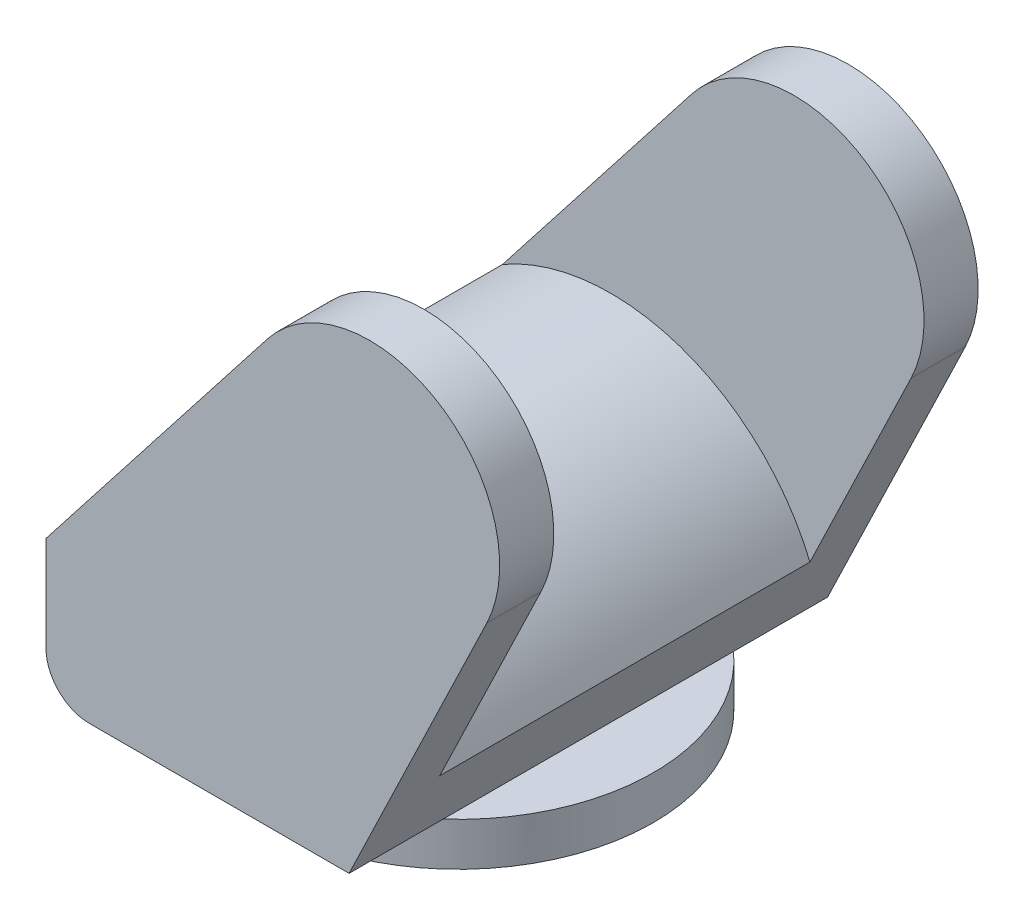
ISO-10303-21;
HEADER;
FILE_DESCRIPTION(('STEP AP214'),'2;1');
FILE_NAME('part.step','',(''),(''),'','','');
FILE_SCHEMA(('AUTOMOTIVE_DESIGN { 1 0 10303 214 1 1 1 1 }'));
ENDSEC;
DATA;
#1=APPLICATION_CONTEXT('core data for automotive mechanical design processes');
#2=APPLICATION_PROTOCOL_DEFINITION('international standard','automotive_design',2000,#1);
#3=PRODUCT_CONTEXT('',#1,'mechanical');
#4=PRODUCT('Part','Part','',(#3));
#5=PRODUCT_RELATED_PRODUCT_CATEGORY('part','',(#4));
#6=PRODUCT_DEFINITION_FORMATION('','',#4);
#7=PRODUCT_DEFINITION_CONTEXT('part definition',#1,'design');
#8=PRODUCT_DEFINITION('design','',#6,#7);
#9=PRODUCT_DEFINITION_SHAPE('','',#8);
#10=(LENGTH_UNIT() NAMED_UNIT(*) SI_UNIT(.MILLI.,.METRE.));
#11=(NAMED_UNIT(*) PLANE_ANGLE_UNIT() SI_UNIT($,.RADIAN.));
#12=(NAMED_UNIT(*) SI_UNIT($,.STERADIAN.) SOLID_ANGLE_UNIT());
#13=UNCERTAINTY_MEASURE_WITH_UNIT(LENGTH_MEASURE(1.E-05),#10,'distance_accuracy_value','');
#14=(GEOMETRIC_REPRESENTATION_CONTEXT(3) GLOBAL_UNCERTAINTY_ASSIGNED_CONTEXT((#13)) GLOBAL_UNIT_ASSIGNED_CONTEXT((#10,
#11,#12)) REPRESENTATION_CONTEXT('',''));
#15=CARTESIAN_POINT('',(0.,0.,0.));
#16=DIRECTION('',(0.,0.,1.));
#17=DIRECTION('',(1.,0.,0.));
#18=AXIS2_PLACEMENT_3D('',#15,#16,#17);
#19=CARTESIAN_POINT('',(64.2928637537417,-51.1093254499614,110.5));
#20=DIRECTION('',(0.,-1.,0.));
#21=DIRECTION('',(-1.,0.,0.));
#22=AXIS2_PLACEMENT_3D('',#19,#20,#21);
#23=PLANE('',#22);
#24=DIRECTION('',(0.,0.,-1.));
#25=VECTOR('',#24,1.);
#26=CARTESIAN_POINT('',(-55.7071362462583,-51.1093254499614,110.5));
#27=LINE('',#26,#25);
#28=CARTESIAN_POINT('',(-55.7071362462583,-51.1093254499614,110.5));
#29=VERTEX_POINT('',#28);
#30=CARTESIAN_POINT('',(-55.7071362462585,-51.1093254499614,67.0820393249939));
#31=VERTEX_POINT('',#30);
#32=EDGE_CURVE('E150',#29,#31,#27,.T.);
#33=ORIENTED_EDGE('',*,*,#32,.T.);
#34=CARTESIAN_POINT('',(4.29286375374131,-51.1093254499614,0.));
#35=DIRECTION('',(0.,-1.,0.));
#36=DIRECTION('',(-1.,0.,0.));
#37=AXIS2_PLACEMENT_3D('',#34,#35,#36);
#38=CIRCLE('',#37,90.);
#39=CARTESIAN_POINT('',(64.2928637537416,-51.1093254499614,67.0820393249935));
#40=VERTEX_POINT('',#39);
#41=EDGE_CURVE('E11',#31,#40,#38,.F.);
#42=ORIENTED_EDGE('',*,*,#41,.T.);
#43=DIRECTION('',(0.,0.,-1.));
#44=VECTOR('',#43,1.);
#45=CARTESIAN_POINT('',(64.2928637537417,-51.1093254499614,110.5));
#46=LINE('',#45,#44);
#47=CARTESIAN_POINT('',(64.2928637537417,-51.1093254499614,110.5));
#48=VERTEX_POINT('',#47);
#49=EDGE_CURVE('E144',#48,#40,#46,.T.);
#50=ORIENTED_EDGE('',*,*,#49,.F.);
#51=DIRECTION('',(-1.,0.,0.));
#52=VECTOR('',#51,1.);
#53=CARTESIAN_POINT('',(64.2928637537417,-51.1093254499614,110.5));
#54=LINE('',#53,#52);
#55=EDGE_CURVE('E176',#48,#29,#54,.T.);
#56=ORIENTED_EDGE('',*,*,#55,.T.);
#57=EDGE_LOOP('',(#33,#42,#50,#56));
#58=FACE_BOUND('',#57,.T.);
#59=ADVANCED_FACE('F34',(#58),#23,.T.);
#60=CARTESIAN_POINT('',(73.8390121494794,106.850674550039,110.5));
#61=DIRECTION('',(0.,0.,-1.));
#62=DIRECTION('',(-1.,0.,0.));
#63=AXIS2_PLACEMENT_3D('',#60,#61,#62);
#64=CYLINDRICAL_SURFACE('',#63,60.);
#65=DIRECTION('',(0.,0.,-1.));
#66=VECTOR('',#65,1.);
#67=CARTESIAN_POINT('',(127.88567183657,80.7938409613649,110.5));
#68=LINE('',#67,#66);
#69=CARTESIAN_POINT('',(127.88567183657,80.7938409613649,110.5));
#70=VERTEX_POINT('',#69);
#71=CARTESIAN_POINT('',(127.88567183657,80.793840961365,85.4999999999996));
#72=VERTEX_POINT('',#71);
#73=EDGE_CURVE('E42',#70,#72,#68,.T.);
#74=ORIENTED_EDGE('',*,*,#73,.T.);
#75=CARTESIAN_POINT('',(73.8390121494793,106.850674550039,85.4999999999997));
#76=DIRECTION('',(0.,0.,-1.));
#77=DIRECTION('',(-1.,0.,0.));
#78=AXIS2_PLACEMENT_3D('',#75,#76,#77);
#79=CIRCLE('',#78,60.);
#80=CARTESIAN_POINT('',(26.5575710181049,143.789344322249,85.4999999999999));
#81=VERTEX_POINT('',#80);
#82=EDGE_CURVE('E215',#81,#72,#79,.T.);
#83=ORIENTED_EDGE('',*,*,#82,.F.);
#84=DIRECTION('',(0.,0.,-1.));
#85=VECTOR('',#84,1.);
#86=CARTESIAN_POINT('',(26.557571018105,143.789344322249,110.5));
#87=LINE('',#86,#85);
#88=CARTESIAN_POINT('',(26.557571018105,143.789344322249,110.5));
#89=VERTEX_POINT('',#88);
#90=EDGE_CURVE('E159',#89,#81,#87,.T.);
#91=ORIENTED_EDGE('',*,*,#90,.F.);
#92=CARTESIAN_POINT('',(73.8390121494794,106.850674550039,110.5));
#93=DIRECTION('',(0.,0.,-1.));
#94=DIRECTION('',(-1.,0.,0.));
#95=AXIS2_PLACEMENT_3D('',#92,#93,#94);
#96=CIRCLE('',#95,60.);
#97=EDGE_CURVE('E143',#89,#70,#96,.T.);
#98=ORIENTED_EDGE('',*,*,#97,.T.);
#99=EDGE_LOOP('',(#74,#83,#91,#98));
#100=FACE_BOUND('',#99,.T.);
#101=ADVANCED_FACE('F236',(#100),#64,.T.);
#102=CARTESIAN_POINT('',(64.2928637537417,-51.1093254499614,110.5));
#103=DIRECTION('',(0.900777661451507,-0.434280559811229,0.));
#104=DIRECTION('',(-0.434280559811229,-0.900777661451507,0.));
#105=AXIS2_PLACEMENT_3D('',#102,#103,#104);
#106=PLANE('',#105);
#107=DIRECTION('',(-0.434280559811229,-0.900777661451507,0.));
#108=VECTOR('',#107,1.);
#109=CARTESIAN_POINT('',(127.885671836569,80.7938409613649,-85.5000000000005));
#110=LINE('',#109,#108);
#111=CARTESIAN_POINT('',(127.885671836569,80.793840961365,-85.5000000000005));
#112=VERTEX_POINT('',#111);
#113=CARTESIAN_POINT('',(81.1498086111907,-16.1449250759018,-85.5000000000003));
#114=VERTEX_POINT('',#113);
#115=EDGE_CURVE('E204',#112,#114,#110,.T.);
#116=ORIENTED_EDGE('',*,*,#115,.T.);
#117=DIRECTION('',(0.,0.,1.));
#118=VECTOR('',#117,1.);
#119=CARTESIAN_POINT('',(81.1498086111907,-16.1449250759018,-85.5000000000003));
#120=LINE('',#119,#118);
#121=CARTESIAN_POINT('',(81.1498086111912,-16.1449250759018,85.4999999999997));
#122=VERTEX_POINT('',#121);
#123=EDGE_CURVE('E196',#114,#122,#120,.T.);
#124=ORIENTED_EDGE('',*,*,#123,.T.);
#125=DIRECTION('',(-0.434280559811229,-0.900777661451507,0.));
#126=VECTOR('',#125,1.);
#127=CARTESIAN_POINT('',(127.88567183657,80.7938409613649,85.4999999999996));
#128=LINE('',#127,#126);
#129=EDGE_CURVE('E213',#72,#122,#128,.T.);
#130=ORIENTED_EDGE('',*,*,#129,.F.);
#131=ORIENTED_EDGE('',*,*,#73,.F.);
#132=DIRECTION('',(-0.434280559811229,-0.900777661451507,0.));
#133=VECTOR('',#132,1.);
#134=CARTESIAN_POINT('',(64.2928637537417,-51.1093254499614,110.5));
#135=LINE('',#134,#133);
#136=EDGE_CURVE('E179',#70,#48,#135,.T.);
#137=ORIENTED_EDGE('',*,*,#136,.T.);
#138=ORIENTED_EDGE('',*,*,#49,.T.);
#139=CARTESIAN_POINT('',(64.2928637537411,-51.1093254499614,-67.0820393249939));
#140=VERTEX_POINT('',#139);
#141=EDGE_CURVE('E126',#40,#140,#46,.T.);
#142=ORIENTED_EDGE('',*,*,#141,.T.);
#143=CARTESIAN_POINT('',(64.2928637537409,-51.1093254499614,-110.5));
#144=VERTEX_POINT('',#143);
#145=EDGE_CURVE('E136',#140,#144,#46,.T.);
#146=ORIENTED_EDGE('',*,*,#145,.T.);
#147=DIRECTION('',(-0.434280559811229,-0.900777661451507,0.));
#148=VECTOR('',#147,1.);
#149=CARTESIAN_POINT('',(64.2928637537409,-51.1093254499614,-110.5));
#150=LINE('',#149,#148);
#151=CARTESIAN_POINT('',(127.885671836569,80.7938409613649,-110.5));
#152=VERTEX_POINT('',#151);
#153=EDGE_CURVE('E194',#152,#144,#150,.T.);
#154=ORIENTED_EDGE('',*,*,#153,.F.);
#155=EDGE_CURVE('E162',#112,#152,#68,.T.);
#156=ORIENTED_EDGE('',*,*,#155,.F.);
#157=EDGE_LOOP('',(#116,#124,#130,#131,#137,#138,#142,#146,#154,#156));
#158=FACE_BOUND('',#157,.T.);
#159=ADVANCED_FACE('F36',(#158),#106,.T.);
#160=CARTESIAN_POINT('',(73.8390121494787,106.850674550039,-85.5000000000003));
#161=DIRECTION('',(0.,0.,-1.));
#162=DIRECTION('',(-1.,0.,0.));
#163=AXIS2_PLACEMENT_3D('',#160,#161,#162);
#164=CIRCLE('',#163,60.);
#165=CARTESIAN_POINT('',(26.5575710181043,143.789344322249,-85.5000000000001));
#166=VERTEX_POINT('',#165);
#167=EDGE_CURVE('E206',#166,#112,#164,.T.);
#168=ORIENTED_EDGE('',*,*,#167,.T.);
#169=ORIENTED_EDGE('',*,*,#155,.T.);
#170=CARTESIAN_POINT('',(73.8390121494786,106.850674550039,-110.5));
#171=DIRECTION('',(0.,0.,-1.));
#172=DIRECTION('',(-1.,0.,0.));
#173=AXIS2_PLACEMENT_3D('',#170,#171,#172);
#174=CIRCLE('',#173,60.);
#175=CARTESIAN_POINT('',(26.5575710181043,143.789344322249,-110.5));
#176=VERTEX_POINT('',#175);
#177=EDGE_CURVE('E181',#176,#152,#174,.T.);
#178=ORIENTED_EDGE('',*,*,#177,.F.);
#179=EDGE_CURVE('E158',#166,#176,#87,.T.);
#180=ORIENTED_EDGE('',*,*,#179,.F.);
#181=EDGE_LOOP('',(#168,#169,#178,#180));
#182=FACE_BOUND('',#181,.T.);
#183=ADVANCED_FACE('F243',(#182),#64,.T.);
#184=CARTESIAN_POINT('',(-75.7071362462583,12.8906745500386,110.5));
#185=DIRECTION('',(-0.78802401885624,0.6156444962035,0.));
#186=DIRECTION('',(0.6156444962035,0.78802401885624,0.));
#187=AXIS2_PLACEMENT_3D('',#184,#185,#186);
#188=PLANE('',#187);
#189=DIRECTION('',(0.6156444962035,0.78802401885624,0.));
#190=VECTOR('',#189,1.);
#191=CARTESIAN_POINT('',(-60.8576190942428,31.8980339211821,-85.4999999999998));
#192=LINE('',#191,#190);
#193=CARTESIAN_POINT('',(-60.8576190942428,31.8980339211821,-85.4999999999998));
#194=VERTEX_POINT('',#193);
#195=EDGE_CURVE('E209',#194,#166,#192,.T.);
#196=ORIENTED_EDGE('',*,*,#195,.T.);
#197=ORIENTED_EDGE('',*,*,#179,.T.);
#198=DIRECTION('',(0.6156444962035,0.78802401885624,0.));
#199=VECTOR('',#198,1.);
#200=CARTESIAN_POINT('',(-75.7071362462591,12.8906745500386,-110.5));
#201=LINE('',#200,#199);
#202=CARTESIAN_POINT('',(-75.7071362462591,12.8906745500386,-110.5));
#203=VERTEX_POINT('',#202);
#204=EDGE_CURVE('E184',#203,#176,#201,.T.);
#205=ORIENTED_EDGE('',*,*,#204,.F.);
#206=DIRECTION('',(0.,0.,-1.));
#207=VECTOR('',#206,1.);
#208=CARTESIAN_POINT('',(-75.7071362462583,12.8906745500386,110.5));
#209=LINE('',#208,#207);
#210=CARTESIAN_POINT('',(-75.7071362462583,12.8906745500386,110.5));
#211=VERTEX_POINT('',#210);
#212=EDGE_CURVE('E156',#211,#203,#209,.T.);
#213=ORIENTED_EDGE('',*,*,#212,.F.);
#214=DIRECTION('',(0.6156444962035,0.78802401885624,0.));
#215=VECTOR('',#214,1.);
#216=CARTESIAN_POINT('',(-75.7071362462583,12.8906745500386,110.5));
#217=LINE('',#216,#215);
#218=EDGE_CURVE('E167',#211,#89,#217,.T.);
#219=ORIENTED_EDGE('',*,*,#218,.T.);
#220=ORIENTED_EDGE('',*,*,#90,.T.);
#221=DIRECTION('',(0.6156444962035,0.78802401885624,0.));
#222=VECTOR('',#221,1.);
#223=CARTESIAN_POINT('',(-60.8576190942422,31.8980339211821,85.5000000000002));
#224=LINE('',#223,#222);
#225=CARTESIAN_POINT('',(-60.8576190942422,31.8980339211821,85.5000000000002));
#226=VERTEX_POINT('',#225);
#227=EDGE_CURVE('E217',#226,#81,#224,.T.);
#228=ORIENTED_EDGE('',*,*,#227,.F.);
#229=DIRECTION('',(0.,0.,1.));
#230=VECTOR('',#229,1.);
#231=CARTESIAN_POINT('',(-60.8576190942428,31.8980339211821,-85.4999999999998));
#232=LINE('',#231,#230);
#233=EDGE_CURVE('E199',#194,#226,#232,.T.);
#234=ORIENTED_EDGE('',*,*,#233,.F.);
#235=EDGE_LOOP('',(#196,#197,#205,#213,#219,#220,#228,#234));
#236=FACE_BOUND('',#235,.T.);
#237=ADVANCED_FACE('F260',(#236),#188,.T.);
#238=CARTESIAN_POINT('',(-75.7071362462583,-31.1093254499614,110.5));
#239=DIRECTION('',(-1.,0.,0.));
#240=DIRECTION('',(0.,0.,1.));
#241=AXIS2_PLACEMENT_3D('',#238,#239,#240);
#242=PLANE('',#241);
#243=ORIENTED_EDGE('',*,*,#212,.T.);
#244=DIRECTION('',(0.,1.,0.));
#245=VECTOR('',#244,1.);
#246=CARTESIAN_POINT('',(-75.7071362462591,-31.1093254499614,-110.5));
#247=LINE('',#246,#245);
#248=CARTESIAN_POINT('',(-75.7071362462591,-31.1093254499614,-110.5));
#249=VERTEX_POINT('',#248);
#250=EDGE_CURVE('E187',#249,#203,#247,.T.);
#251=ORIENTED_EDGE('',*,*,#250,.F.);
#252=DIRECTION('',(0.,0.,-1.));
#253=VECTOR('',#252,1.);
#254=CARTESIAN_POINT('',(-75.7071362462583,-31.1093254499614,110.5));
#255=LINE('',#254,#253);
#256=CARTESIAN_POINT('',(-75.7071362462583,-31.1093254499614,110.5));
#257=VERTEX_POINT('',#256);
#258=EDGE_CURVE('E153',#257,#249,#255,.T.);
#259=ORIENTED_EDGE('',*,*,#258,.F.);
#260=DIRECTION('',(0.,1.,0.));
#261=VECTOR('',#260,1.);
#262=CARTESIAN_POINT('',(-75.7071362462583,-31.1093254499614,110.5));
#263=LINE('',#262,#261);
#264=EDGE_CURVE('E170',#257,#211,#263,.T.);
#265=ORIENTED_EDGE('',*,*,#264,.T.);
#266=EDGE_LOOP('',(#243,#251,#259,#265));
#267=FACE_BOUND('',#266,.T.);
#268=ADVANCED_FACE('F255',(#267),#242,.T.);
#269=CARTESIAN_POINT('',(-55.7071362462583,-31.1093254499614,110.5));
#270=DIRECTION('',(0.,0.,-1.));
#271=DIRECTION('',(-1.,0.,0.));
#272=AXIS2_PLACEMENT_3D('',#269,#270,#271);
#273=CYLINDRICAL_SURFACE('',#272,20.);
#274=ORIENTED_EDGE('',*,*,#258,.T.);
#275=CARTESIAN_POINT('',(-55.7071362462591,-31.1093254499614,-110.5));
#276=DIRECTION('',(0.,0.,-1.));
#277=DIRECTION('',(1.,0.,0.));
#278=AXIS2_PLACEMENT_3D('',#275,#276,#277);
#279=CIRCLE('',#278,20.);
#280=CARTESIAN_POINT('',(-55.7071362462591,-51.1093254499614,-110.5));
#281=VERTEX_POINT('',#280);
#282=EDGE_CURVE('E190',#281,#249,#279,.T.);
#283=ORIENTED_EDGE('',*,*,#282,.F.);
#284=CARTESIAN_POINT('',(-55.7071362462589,-51.1093254499614,-67.0820393249935));
#285=VERTEX_POINT('',#284);
#286=EDGE_CURVE('E148',#285,#281,#27,.T.);
#287=ORIENTED_EDGE('',*,*,#286,.F.);
#288=EDGE_CURVE('E154',#31,#285,#27,.T.);
#289=ORIENTED_EDGE('',*,*,#288,.F.);
#290=ORIENTED_EDGE('',*,*,#32,.F.);
#291=CARTESIAN_POINT('',(-55.7071362462583,-31.1093254499614,110.5));
#292=DIRECTION('',(0.,0.,-1.));
#293=DIRECTION('',(1.,0.,0.));
#294=AXIS2_PLACEMENT_3D('',#291,#292,#293);
#295=CIRCLE('',#294,20.);
#296=EDGE_CURVE('E173',#29,#257,#295,.T.);
#297=ORIENTED_EDGE('',*,*,#296,.T.);
#298=EDGE_LOOP('',(#274,#283,#287,#289,#290,#297));
#299=FACE_BOUND('',#298,.T.);
#300=ADVANCED_FACE('F247',(#299),#273,.T.);
#301=ORIENTED_EDGE('',*,*,#145,.F.);
#302=CARTESIAN_POINT('',(4.29286375374131,-51.1093254499614,0.));
#303=DIRECTION('',(0.,-1.,0.));
#304=DIRECTION('',(-1.,0.,0.));
#305=AXIS2_PLACEMENT_3D('',#302,#303,#304);
#306=CIRCLE('',#305,90.);
#307=EDGE_CURVE('E127',#285,#140,#306,.T.);
#308=ORIENTED_EDGE('',*,*,#307,.F.);
#309=ORIENTED_EDGE('',*,*,#286,.T.);
#310=DIRECTION('',(-1.,0.,0.));
#311=VECTOR('',#310,1.);
#312=CARTESIAN_POINT('',(64.2928637537409,-51.1093254499614,-110.5));
#313=LINE('',#312,#311);
#314=EDGE_CURVE('E139',#144,#281,#313,.T.);
#315=ORIENTED_EDGE('',*,*,#314,.F.);
#316=EDGE_LOOP('',(#301,#308,#309,#315));
#317=FACE_BOUND('',#316,.T.);
#318=ADVANCED_FACE('F137',(#317),#23,.T.);
#319=CARTESIAN_POINT('',(73.8390121494794,106.850674550039,110.5));
#320=DIRECTION('',(0.,0.,-1.));
#321=DIRECTION('',(-1.,0.,0.));
#322=AXIS2_PLACEMENT_3D('',#319,#320,#321);
#323=PLANE('',#322);
#324=ORIENTED_EDGE('',*,*,#136,.F.);
#325=ORIENTED_EDGE('',*,*,#97,.F.);
#326=ORIENTED_EDGE('',*,*,#218,.F.);
#327=ORIENTED_EDGE('',*,*,#264,.F.);
#328=ORIENTED_EDGE('',*,*,#296,.F.);
#329=ORIENTED_EDGE('',*,*,#55,.F.);
#330=EDGE_LOOP('',(#324,#325,#326,#327,#328,#329));
#331=FACE_BOUND('',#330,.T.);
#332=ADVANCED_FACE('F246',(#331),#323,.F.);
#333=CARTESIAN_POINT('',(73.8390121494786,106.850674550039,-110.5));
#334=DIRECTION('',(0.,0.,-1.));
#335=DIRECTION('',(-1.,0.,0.));
#336=AXIS2_PLACEMENT_3D('',#333,#334,#335);
#337=PLANE('',#336);
#338=ORIENTED_EDGE('',*,*,#153,.T.);
#339=ORIENTED_EDGE('',*,*,#314,.T.);
#340=ORIENTED_EDGE('',*,*,#282,.T.);
#341=ORIENTED_EDGE('',*,*,#250,.T.);
#342=ORIENTED_EDGE('',*,*,#204,.T.);
#343=ORIENTED_EDGE('',*,*,#177,.T.);
#344=EDGE_LOOP('',(#338,#339,#340,#341,#342,#343));
#345=FACE_BOUND('',#344,.T.);
#346=ADVANCED_FACE('F252',(#345),#337,.T.);
#347=CARTESIAN_POINT('',(-10.8456870251318,-54.1718496780431,-85.5));
#348=DIRECTION('',(0.,0.,1.));
#349=DIRECTION('',(1.,0.,0.));
#350=AXIS2_PLACEMENT_3D('',#347,#348,#349);
#351=CYLINDRICAL_SURFACE('',#350,99.545056191001);
#352=ORIENTED_EDGE('',*,*,#123,.F.);
#353=CARTESIAN_POINT('',(-10.8456870251318,-54.1718496780431,-85.5));
#354=DIRECTION('',(0.,0.,-1.));
#355=DIRECTION('',(-1.,0.,0.));
#356=AXIS2_PLACEMENT_3D('',#353,#354,#355);
#357=CIRCLE('',#356,99.545056191001);
#358=EDGE_CURVE('E201',#194,#114,#357,.T.);
#359=ORIENTED_EDGE('',*,*,#358,.F.);
#360=ORIENTED_EDGE('',*,*,#233,.T.);
#361=CARTESIAN_POINT('',(-10.8456870251312,-54.1718496780431,85.5));
#362=DIRECTION('',(0.,0.,-1.));
#363=DIRECTION('',(-1.,0.,0.));
#364=AXIS2_PLACEMENT_3D('',#361,#362,#363);
#365=CIRCLE('',#364,99.545056191001);
#366=EDGE_CURVE('E57',#226,#122,#365,.T.);
#367=ORIENTED_EDGE('',*,*,#366,.T.);
#368=EDGE_LOOP('',(#352,#359,#360,#367));
#369=FACE_BOUND('',#368,.T.);
#370=ADVANCED_FACE('F271',(#369),#351,.T.);
#371=CARTESIAN_POINT('',(73.8390121494787,106.850674550039,-85.5000000000003));
#372=DIRECTION('',(0.,0.,-1.));
#373=DIRECTION('',(-1.,0.,0.));
#374=AXIS2_PLACEMENT_3D('',#371,#372,#373);
#375=PLANE('',#374);
#376=ORIENTED_EDGE('',*,*,#195,.F.);
#377=ORIENTED_EDGE('',*,*,#358,.T.);
#378=ORIENTED_EDGE('',*,*,#115,.F.);
#379=ORIENTED_EDGE('',*,*,#167,.F.);
#380=EDGE_LOOP('',(#376,#377,#378,#379));
#381=FACE_BOUND('',#380,.T.);
#382=ADVANCED_FACE('F275',(#381),#375,.F.);
#383=CARTESIAN_POINT('',(73.8390121494793,106.850674550039,85.4999999999997));
#384=DIRECTION('',(0.,0.,-1.));
#385=DIRECTION('',(-1.,0.,0.));
#386=AXIS2_PLACEMENT_3D('',#383,#384,#385);
#387=PLANE('',#386);
#388=ORIENTED_EDGE('',*,*,#227,.T.);
#389=ORIENTED_EDGE('',*,*,#82,.T.);
#390=ORIENTED_EDGE('',*,*,#129,.T.);
#391=ORIENTED_EDGE('',*,*,#366,.F.);
#392=EDGE_LOOP('',(#388,#389,#390,#391));
#393=FACE_BOUND('',#392,.T.);
#394=ADVANCED_FACE('F232',(#393),#387,.T.);
#395=CARTESIAN_POINT('',(4.29286375374131,-51.1093254499614,0.));
#396=DIRECTION('',(0.,-1.,0.));
#397=DIRECTION('',(-1.,0.,0.));
#398=AXIS2_PLACEMENT_3D('',#395,#396,#397);
#399=PLANE('',#398);
#400=ORIENTED_EDGE('',*,*,#141,.F.);
#401=EDGE_CURVE('E123',#140,#40,#306,.T.);
#402=ORIENTED_EDGE('',*,*,#401,.F.);
#403=EDGE_LOOP('',(#400,#402));
#404=FACE_BOUND('',#403,.T.);
#405=ADVANCED_FACE('F124',(#404),#399,.F.);
#406=CARTESIAN_POINT('',(4.29286375374131,-71.1093254499614,0.));
#407=DIRECTION('',(0.,1.,0.));
#408=DIRECTION('',(1.,0.,0.));
#409=AXIS2_PLACEMENT_3D('',#406,#407,#408);
#410=CYLINDRICAL_SURFACE('',#409,90.);
#411=CARTESIAN_POINT('',(4.29286375374131,-71.1093254499614,0.));
#412=DIRECTION('',(0.,-1.,0.));
#413=DIRECTION('',(-1.,0.,0.));
#414=AXIS2_PLACEMENT_3D('',#411,#412,#413);
#415=CIRCLE('',#414,90.);
#416=CARTESIAN_POINT('',(-85.7071362462587,-71.1093254499614,2.99244866809498E-13));
#417=VERTEX_POINT('',#416);
#418=EDGE_CURVE('E134',#417,#417,#415,.T.);
#419=ORIENTED_EDGE('',*,*,#418,.F.);
#420=EDGE_LOOP('',(#419));
#421=FACE_BOUND('',#420,.T.);
#422=ORIENTED_EDGE('',*,*,#307,.T.);
#423=ORIENTED_EDGE('',*,*,#401,.T.);
#424=ORIENTED_EDGE('',*,*,#41,.F.);
#425=EDGE_CURVE('E49',#31,#285,#306,.T.);
#426=ORIENTED_EDGE('',*,*,#425,.T.);
#427=EDGE_LOOP('',(#422,#423,#424,#426));
#428=FACE_BOUND('',#427,.T.);
#429=ADVANCED_FACE('F131',(#421,#428),#410,.T.);
#430=CARTESIAN_POINT('',(4.29286375374131,-71.1093254499614,0.));
#431=DIRECTION('',(0.,-1.,0.));
#432=DIRECTION('',(-1.,0.,0.));
#433=AXIS2_PLACEMENT_3D('',#430,#431,#432);
#434=PLANE('',#433);
#435=ORIENTED_EDGE('',*,*,#418,.T.);
#436=EDGE_LOOP('',(#435));
#437=FACE_BOUND('',#436,.T.);
#438=ADVANCED_FACE('F222',(#437),#434,.T.);
#439=ORIENTED_EDGE('',*,*,#288,.T.);
#440=ORIENTED_EDGE('',*,*,#425,.F.);
#441=EDGE_LOOP('',(#439,#440));
#442=FACE_BOUND('',#441,.T.);
#443=ADVANCED_FACE('F230',(#442),#399,.F.);
#444=CLOSED_SHELL('',(#59,#101,#159,#183,#237,#268,#300,#318,#332,#346,#370,#382,#394,#405,#429,
#438,#443));
#445=MANIFOLD_SOLID_BREP('B2',#444);
#446=ADVANCED_BREP_SHAPE_REPRESENTATION('',(#18,#445),#14);
#447=SHAPE_DEFINITION_REPRESENTATION(#9,#446);
ENDSEC;
END-ISO-10303-21;
